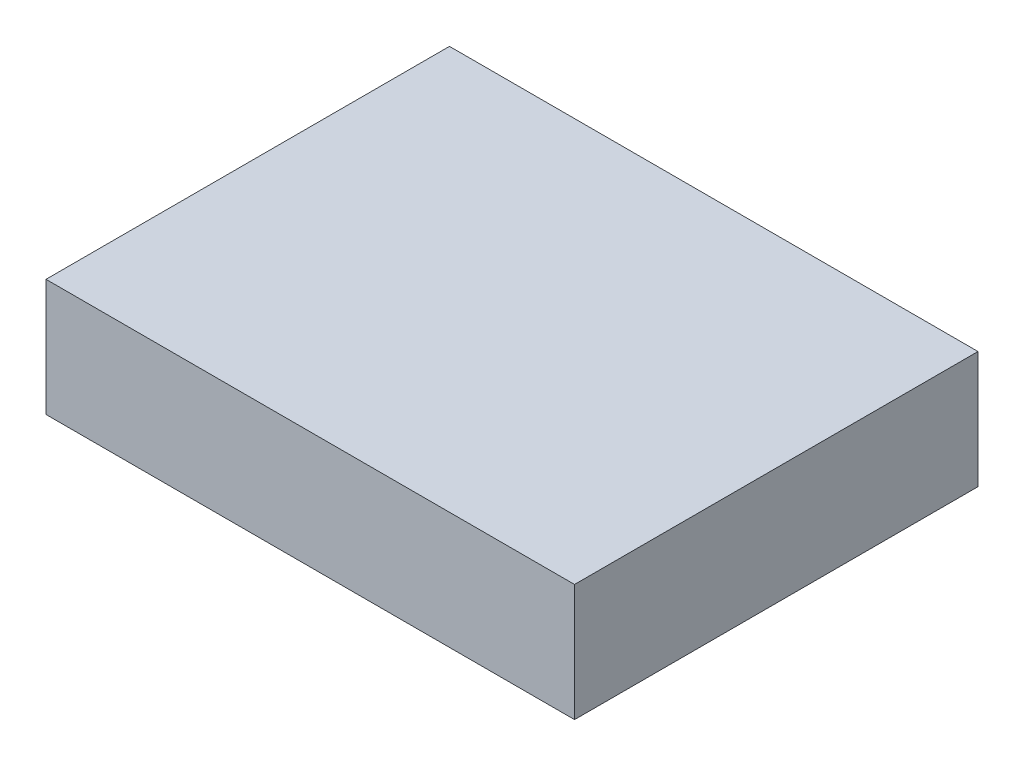
ISO-10303-21;
HEADER;
FILE_DESCRIPTION(('STEP AP214'),'2;1');
FILE_NAME('part.step','',(''),(''),'','','');
FILE_SCHEMA(('AUTOMOTIVE_DESIGN { 1 0 10303 214 1 1 1 1 }'));
ENDSEC;
DATA;
#1=APPLICATION_CONTEXT('core data for automotive mechanical design processes');
#2=APPLICATION_PROTOCOL_DEFINITION('international standard','automotive_design',2000,#1);
#3=PRODUCT_CONTEXT('',#1,'mechanical');
#4=PRODUCT('Part','Part','',(#3));
#5=PRODUCT_RELATED_PRODUCT_CATEGORY('part','',(#4));
#6=PRODUCT_DEFINITION_FORMATION('','',#4);
#7=PRODUCT_DEFINITION_CONTEXT('part definition',#1,'design');
#8=PRODUCT_DEFINITION('design','',#6,#7);
#9=PRODUCT_DEFINITION_SHAPE('','',#8);
#10=(LENGTH_UNIT() NAMED_UNIT(*) SI_UNIT(.MILLI.,.METRE.));
#11=(NAMED_UNIT(*) PLANE_ANGLE_UNIT() SI_UNIT($,.RADIAN.));
#12=(NAMED_UNIT(*) SI_UNIT($,.STERADIAN.) SOLID_ANGLE_UNIT());
#13=UNCERTAINTY_MEASURE_WITH_UNIT(LENGTH_MEASURE(1.E-05),#10,'distance_accuracy_value','');
#14=(GEOMETRIC_REPRESENTATION_CONTEXT(3) GLOBAL_UNCERTAINTY_ASSIGNED_CONTEXT((#13)) GLOBAL_UNIT_ASSIGNED_CONTEXT((#10,
#11,#12)) REPRESENTATION_CONTEXT('',''));
#15=CARTESIAN_POINT('',(0.,0.,0.));
#16=DIRECTION('',(0.,0.,1.));
#17=DIRECTION('',(1.,0.,0.));
#18=AXIS2_PLACEMENT_3D('',#15,#16,#17);
#19=CARTESIAN_POINT('',(-111.585836478848,150.,86.1531671959199));
#20=DIRECTION('',(-1.,0.,0.));
#21=DIRECTION('',(0.,0.,1.));
#22=AXIS2_PLACEMENT_3D('',#19,#20,#21);
#23=PLANE('',#22);
#24=DIRECTION('',(0.,0.,-1.));
#25=VECTOR('',#24,1.);
#26=CARTESIAN_POINT('',(-111.585836478848,100.,86.1531671959199));
#27=LINE('',#26,#25);
#28=CARTESIAN_POINT('',(-111.585836478848,100.,86.1531671959199));
#29=VERTEX_POINT('',#28);
#30=CARTESIAN_POINT('',(-111.585836478848,100.,-86.1531671959199));
#31=VERTEX_POINT('',#30);
#32=EDGE_CURVE('E232',#29,#31,#27,.T.);
#33=ORIENTED_EDGE('',*,*,#32,.F.);
#34=DIRECTION('',(0.,-1.,0.));
#35=VECTOR('',#34,1.);
#36=CARTESIAN_POINT('',(-111.585836478848,150.,86.1531671959199));
#37=LINE('',#36,#35);
#38=CARTESIAN_POINT('',(-111.585836478848,150.,86.1531671959199));
#39=VERTEX_POINT('',#38);
#40=EDGE_CURVE('E242',#39,#29,#37,.T.);
#41=ORIENTED_EDGE('',*,*,#40,.F.);
#42=DIRECTION('',(0.,0.,-1.));
#43=VECTOR('',#42,1.);
#44=CARTESIAN_POINT('',(-111.585836478848,150.,86.1531671959199));
#45=LINE('',#44,#43);
#46=CARTESIAN_POINT('',(-111.585836478848,150.,-86.1531671959199));
#47=VERTEX_POINT('',#46);
#48=EDGE_CURVE('E256',#39,#47,#45,.T.);
#49=ORIENTED_EDGE('',*,*,#48,.T.);
#50=DIRECTION('',(0.,-1.,0.));
#51=VECTOR('',#50,1.);
#52=CARTESIAN_POINT('',(-111.585836478848,150.,-86.1531671959199));
#53=LINE('',#52,#51);
#54=EDGE_CURVE('E253',#47,#31,#53,.T.);
#55=ORIENTED_EDGE('',*,*,#54,.T.);
#56=EDGE_LOOP('',(#33,#41,#49,#55));
#57=FACE_BOUND('',#56,.T.);
#58=ADVANCED_FACE('F41',(#57),#23,.T.);
#59=CARTESIAN_POINT('',(-111.585836478848,150.,86.1531671959199));
#60=DIRECTION('',(0.,0.,1.));
#61=DIRECTION('',(1.,0.,0.));
#62=AXIS2_PLACEMENT_3D('',#59,#60,#61);
#63=PLANE('',#62);
#64=DIRECTION('',(-1.,0.,0.));
#65=VECTOR('',#64,1.);
#66=CARTESIAN_POINT('',(-111.585836478848,100.,86.1531671959199));
#67=LINE('',#66,#65);
#68=CARTESIAN_POINT('',(114.129103407141,100.,86.1531671959199));
#69=VERTEX_POINT('',#68);
#70=EDGE_CURVE('E149',#69,#29,#67,.T.);
#71=ORIENTED_EDGE('',*,*,#70,.F.);
#72=DIRECTION('',(0.,-1.,0.));
#73=VECTOR('',#72,1.);
#74=CARTESIAN_POINT('',(114.129103407141,150.,86.1531671959199));
#75=LINE('',#74,#73);
#76=CARTESIAN_POINT('',(114.129103407141,150.,86.1531671959199));
#77=VERTEX_POINT('',#76);
#78=EDGE_CURVE('E247',#77,#69,#75,.T.);
#79=ORIENTED_EDGE('',*,*,#78,.F.);
#80=DIRECTION('',(-1.,0.,0.));
#81=VECTOR('',#80,1.);
#82=CARTESIAN_POINT('',(-111.585836478848,150.,86.1531671959199));
#83=LINE('',#82,#81);
#84=EDGE_CURVE('E246',#77,#39,#83,.T.);
#85=ORIENTED_EDGE('',*,*,#84,.T.);
#86=ORIENTED_EDGE('',*,*,#40,.T.);
#87=EDGE_LOOP('',(#71,#79,#85,#86));
#88=FACE_BOUND('',#87,.T.);
#89=ADVANCED_FACE('F450',(#88),#63,.T.);
#90=CARTESIAN_POINT('',(114.129103407141,150.,86.1531671959199));
#91=DIRECTION('',(1.,0.,0.));
#92=DIRECTION('',(0.,0.,-1.));
#93=AXIS2_PLACEMENT_3D('',#90,#91,#92);
#94=PLANE('',#93);
#95=DIRECTION('',(0.,0.,1.));
#96=VECTOR('',#95,1.);
#97=CARTESIAN_POINT('',(114.129103407141,100.,86.1531671959199));
#98=LINE('',#97,#96);
#99=CARTESIAN_POINT('',(114.129103407141,100.,-86.1531671959199));
#100=VERTEX_POINT('',#99);
#101=EDGE_CURVE('E171',#100,#69,#98,.T.);
#102=ORIENTED_EDGE('',*,*,#101,.F.);
#103=DIRECTION('',(0.,-1.,0.));
#104=VECTOR('',#103,1.);
#105=CARTESIAN_POINT('',(114.129103407141,150.,-86.1531671959199));
#106=LINE('',#105,#104);
#107=CARTESIAN_POINT('',(114.129103407141,150.,-86.1531671959199));
#108=VERTEX_POINT('',#107);
#109=EDGE_CURVE('E212',#108,#100,#106,.T.);
#110=ORIENTED_EDGE('',*,*,#109,.F.);
#111=DIRECTION('',(0.,0.,1.));
#112=VECTOR('',#111,1.);
#113=CARTESIAN_POINT('',(114.129103407141,150.,86.1531671959199));
#114=LINE('',#113,#112);
#115=EDGE_CURVE('E245',#108,#77,#114,.T.);
#116=ORIENTED_EDGE('',*,*,#115,.T.);
#117=ORIENTED_EDGE('',*,*,#78,.T.);
#118=EDGE_LOOP('',(#102,#110,#116,#117));
#119=FACE_BOUND('',#118,.T.);
#120=ADVANCED_FACE('F457',(#119),#94,.T.);
#121=CARTESIAN_POINT('',(-111.585836478848,150.,-86.1531671959199));
#122=DIRECTION('',(0.,0.,-1.));
#123=DIRECTION('',(-1.,0.,0.));
#124=AXIS2_PLACEMENT_3D('',#121,#122,#123);
#125=PLANE('',#124);
#126=DIRECTION('',(1.,0.,0.));
#127=VECTOR('',#126,1.);
#128=CARTESIAN_POINT('',(-111.585836478848,100.,-86.1531671959199));
#129=LINE('',#128,#127);
#130=EDGE_CURVE('E235',#31,#100,#129,.T.);
#131=ORIENTED_EDGE('',*,*,#130,.F.);
#132=ORIENTED_EDGE('',*,*,#54,.F.);
#133=DIRECTION('',(1.,0.,0.));
#134=VECTOR('',#133,1.);
#135=CARTESIAN_POINT('',(-111.585836478848,150.,-86.1531671959199));
#136=LINE('',#135,#134);
#137=EDGE_CURVE('E250',#47,#108,#136,.T.);
#138=ORIENTED_EDGE('',*,*,#137,.T.);
#139=ORIENTED_EDGE('',*,*,#109,.T.);
#140=EDGE_LOOP('',(#131,#132,#138,#139));
#141=FACE_BOUND('',#140,.T.);
#142=ADVANCED_FACE('F648',(#141),#125,.T.);
#143=CARTESIAN_POINT('',(0.,150.,0.));
#144=DIRECTION('',(0.,-1.,0.));
#145=DIRECTION('',(0.,0.,-1.));
#146=AXIS2_PLACEMENT_3D('',#143,#144,#145);
#147=PLANE('',#146);
#148=ORIENTED_EDGE('',*,*,#48,.F.);
#149=ORIENTED_EDGE('',*,*,#84,.F.);
#150=ORIENTED_EDGE('',*,*,#115,.F.);
#151=ORIENTED_EDGE('',*,*,#137,.F.);
#152=EDGE_LOOP('',(#148,#149,#150,#151));
#153=FACE_BOUND('',#152,.T.);
#154=ADVANCED_FACE('F466',(#153),#147,.F.);
#155=CARTESIAN_POINT('',(0.,100.,0.));
#156=DIRECTION('',(0.,-1.,0.));
#157=DIRECTION('',(0.,0.,-1.));
#158=AXIS2_PLACEMENT_3D('',#155,#156,#157);
#159=PLANE('',#158);
#160=DIRECTION('',(1.,0.,0.));
#161=VECTOR('',#160,1.);
#162=CARTESIAN_POINT('',(0.,100.,11.3837952969598));
#163=LINE('',#162,#161);
#164=CARTESIAN_POINT('',(-36.,100.,11.3837952969598));
#165=VERTEX_POINT('',#164);
#166=CARTESIAN_POINT('',(36.,100.,11.3837952969598));
#167=VERTEX_POINT('',#166);
#168=EDGE_CURVE('E155',#165,#167,#163,.T.);
#169=ORIENTED_EDGE('',*,*,#168,.F.);
#170=DIRECTION('',(0.,0.,1.));
#171=VECTOR('',#170,1.);
#172=CARTESIAN_POINT('',(-36.,100.,0.));
#173=LINE('',#172,#171);
#174=CARTESIAN_POINT('',(-36.,100.,-15.2367721667));
#175=VERTEX_POINT('',#174);
#176=EDGE_CURVE('E228',#175,#165,#173,.T.);
#177=ORIENTED_EDGE('',*,*,#176,.F.);
#178=DIRECTION('',(-1.,0.,0.));
#179=VECTOR('',#178,1.);
#180=CARTESIAN_POINT('',(0.,100.,-15.2367721667));
#181=LINE('',#180,#179);
#182=CARTESIAN_POINT('',(36.,100.,-15.2367721667));
#183=VERTEX_POINT('',#182);
#184=EDGE_CURVE('E219',#183,#175,#181,.T.);
#185=ORIENTED_EDGE('',*,*,#184,.F.);
#186=DIRECTION('',(0.,0.,-1.));
#187=VECTOR('',#186,1.);
#188=CARTESIAN_POINT('',(36.,100.,0.));
#189=LINE('',#188,#187);
#190=EDGE_CURVE('E213',#167,#183,#189,.T.);
#191=ORIENTED_EDGE('',*,*,#190,.F.);
#192=EDGE_LOOP('',(#169,#177,#185,#191));
#193=FACE_BOUND('',#192,.T.);
#194=ADVANCED_FACE('F293',(#193),#159,.T.);
#195=CARTESIAN_POINT('',(0.,100.,-60.));
#196=DIRECTION('',(0.,0.0174524064372835,-0.999847695156391));
#197=DIRECTION('',(0.,0.999847695156391,0.0174524064372835));
#198=AXIS2_PLACEMENT_3D('',#195,#196,#197);
#199=PLANE('',#198);
#200=DIRECTION('',(1.,0.,0.));
#201=VECTOR('',#200,1.);
#202=CARTESIAN_POINT('',(0.,107.,-59.8778145455025));
#203=LINE('',#202,#201);
#204=CARTESIAN_POINT('',(80.,107.,-59.8778145455025));
#205=VERTEX_POINT('',#204);
#206=CARTESIAN_POINT('',(-80.,107.,-59.8778145455025));
#207=VERTEX_POINT('',#206);
#208=EDGE_CURVE('E137',#205,#207,#203,.F.);
#209=ORIENTED_EDGE('',*,*,#208,.T.);
#210=DIRECTION('',(0.,-0.999847695156391,-0.0174524064372835));
#211=VECTOR('',#210,1.);
#212=CARTESIAN_POINT('',(-80.,100.,-60.));
#213=LINE('',#212,#211);
#214=CARTESIAN_POINT('',(-80.,100.,-60.));
#215=VERTEX_POINT('',#214);
#216=EDGE_CURVE('E194',#215,#207,#213,.F.);
#217=ORIENTED_EDGE('',*,*,#216,.F.);
#218=DIRECTION('',(1.,0.,0.));
#219=VECTOR('',#218,1.);
#220=CARTESIAN_POINT('',(0.,100.,-60.));
#221=LINE('',#220,#219);
#222=CARTESIAN_POINT('',(80.,100.,-60.));
#223=VERTEX_POINT('',#222);
#224=EDGE_CURVE('E170',#223,#215,#221,.F.);
#225=ORIENTED_EDGE('',*,*,#224,.F.);
#226=DIRECTION('',(0.,-0.999847695156391,-0.0174524064372835));
#227=VECTOR('',#226,1.);
#228=CARTESIAN_POINT('',(80.,100.,-60.));
#229=LINE('',#228,#227);
#230=EDGE_CURVE('E138',#205,#223,#229,.T.);
#231=ORIENTED_EDGE('',*,*,#230,.F.);
#232=EDGE_LOOP('',(#209,#217,#225,#231));
#233=FACE_BOUND('',#232,.T.);
#234=ADVANCED_FACE('F465',(#233),#199,.F.);
#235=CARTESIAN_POINT('',(-80.,100.,-55.));
#236=DIRECTION('',(0.,-1.,0.));
#237=DIRECTION('',(0.,0.,1.));
#238=AXIS2_PLACEMENT_3D('',#235,#236,#237);
#239=CONICAL_SURFACE('',#238,5.,0.0174532925199433);
#240=CARTESIAN_POINT('',(-80.,107.,-55.));
#241=DIRECTION('',(0.,1.,0.));
#242=DIRECTION('',(0.,0.,1.));
#243=AXIS2_PLACEMENT_3D('',#240,#241,#242);
#244=CIRCLE('',#243,4.87781454550248);
#245=CARTESIAN_POINT('',(-84.8778145455025,107.,-55.));
#246=VERTEX_POINT('',#245);
#247=EDGE_CURVE('E204',#207,#246,#244,.T.);
#248=ORIENTED_EDGE('',*,*,#247,.T.);
#249=DIRECTION('',(-0.0174524064372835,-0.999847695156391,0.));
#250=VECTOR('',#249,1.);
#251=CARTESIAN_POINT('',(-85.,100.,-55.));
#252=LINE('',#251,#250);
#253=CARTESIAN_POINT('',(-85.,100.,-55.));
#254=VERTEX_POINT('',#253);
#255=EDGE_CURVE('E201',#246,#254,#252,.T.);
#256=ORIENTED_EDGE('',*,*,#255,.T.);
#257=CARTESIAN_POINT('',(-80.,100.,-55.));
#258=DIRECTION('',(0.,-1.,0.));
#259=DIRECTION('',(0.,0.,-1.));
#260=AXIS2_PLACEMENT_3D('',#257,#258,#259);
#261=CIRCLE('',#260,5.);
#262=EDGE_CURVE('E197',#254,#215,#261,.T.);
#263=ORIENTED_EDGE('',*,*,#262,.T.);
#264=ORIENTED_EDGE('',*,*,#216,.T.);
#265=EDGE_LOOP('',(#248,#256,#263,#264));
#266=FACE_BOUND('',#265,.T.);
#267=ADVANCED_FACE('F469',(#266),#239,.F.);
#268=CARTESIAN_POINT('',(-85.,100.,0.));
#269=DIRECTION('',(-0.999847695156391,0.0174524064372835,0.));
#270=DIRECTION('',(-0.0174524064372835,-0.999847695156391,0.));
#271=AXIS2_PLACEMENT_3D('',#268,#269,#270);
#272=PLANE('',#271);
#273=DIRECTION('',(0.,0.,-1.));
#274=VECTOR('',#273,1.);
#275=CARTESIAN_POINT('',(-85.,100.,0.));
#276=LINE('',#275,#274);
#277=CARTESIAN_POINT('',(-85.,100.,55.));
#278=VERTEX_POINT('',#277);
#279=EDGE_CURVE('E53',#254,#278,#276,.F.);
#280=ORIENTED_EDGE('',*,*,#279,.F.);
#281=ORIENTED_EDGE('',*,*,#255,.F.);
#282=DIRECTION('',(0.,0.,-1.));
#283=VECTOR('',#282,1.);
#284=CARTESIAN_POINT('',(-84.8778145455025,107.,0.));
#285=LINE('',#284,#283);
#286=CARTESIAN_POINT('',(-84.8778145455025,107.,55.));
#287=VERTEX_POINT('',#286);
#288=EDGE_CURVE('E190',#246,#287,#285,.F.);
#289=ORIENTED_EDGE('',*,*,#288,.T.);
#290=DIRECTION('',(-0.0174524064372835,-0.999847695156391,0.));
#291=VECTOR('',#290,1.);
#292=CARTESIAN_POINT('',(-85.,100.,55.));
#293=LINE('',#292,#291);
#294=EDGE_CURVE('E179',#278,#287,#293,.F.);
#295=ORIENTED_EDGE('',*,*,#294,.F.);
#296=EDGE_LOOP('',(#280,#281,#289,#295));
#297=FACE_BOUND('',#296,.T.);
#298=ADVANCED_FACE('F473',(#297),#272,.F.);
#299=CARTESIAN_POINT('',(-80.,100.,55.));
#300=DIRECTION('',(0.,-1.,0.));
#301=DIRECTION('',(0.,0.,1.));
#302=AXIS2_PLACEMENT_3D('',#299,#300,#301);
#303=CONICAL_SURFACE('',#302,5.,0.0174532925199433);
#304=CARTESIAN_POINT('',(-80.,107.,55.));
#305=DIRECTION('',(0.,1.,0.));
#306=DIRECTION('',(0.,0.,1.));
#307=AXIS2_PLACEMENT_3D('',#304,#305,#306);
#308=CIRCLE('',#307,4.87781454550248);
#309=CARTESIAN_POINT('',(-80.,107.,59.8778145455025));
#310=VERTEX_POINT('',#309);
#311=EDGE_CURVE('E188',#287,#310,#308,.T.);
#312=ORIENTED_EDGE('',*,*,#311,.T.);
#313=DIRECTION('',(0.,-0.999847695156391,0.0174524064372835));
#314=VECTOR('',#313,1.);
#315=CARTESIAN_POINT('',(-80.,100.,60.));
#316=LINE('',#315,#314);
#317=CARTESIAN_POINT('',(-80.,100.,60.));
#318=VERTEX_POINT('',#317);
#319=EDGE_CURVE('E185',#310,#318,#316,.T.);
#320=ORIENTED_EDGE('',*,*,#319,.T.);
#321=CARTESIAN_POINT('',(-80.,100.,55.));
#322=DIRECTION('',(0.,-1.,0.));
#323=DIRECTION('',(0.,0.,-1.));
#324=AXIS2_PLACEMENT_3D('',#321,#322,#323);
#325=CIRCLE('',#324,5.);
#326=EDGE_CURVE('E181',#318,#278,#325,.T.);
#327=ORIENTED_EDGE('',*,*,#326,.T.);
#328=ORIENTED_EDGE('',*,*,#294,.T.);
#329=EDGE_LOOP('',(#312,#320,#327,#328));
#330=FACE_BOUND('',#329,.T.);
#331=ADVANCED_FACE('F477',(#330),#303,.F.);
#332=CARTESIAN_POINT('',(0.,100.,60.));
#333=DIRECTION('',(0.,0.0174524064372835,0.999847695156391));
#334=DIRECTION('',(0.,-0.999847695156391,0.0174524064372835));
#335=AXIS2_PLACEMENT_3D('',#332,#333,#334);
#336=PLANE('',#335);
#337=DIRECTION('',(-1.,0.,0.));
#338=VECTOR('',#337,1.);
#339=CARTESIAN_POINT('',(0.,100.,60.));
#340=LINE('',#339,#338);
#341=CARTESIAN_POINT('',(80.,100.,60.));
#342=VERTEX_POINT('',#341);
#343=EDGE_CURVE('E11',#318,#342,#340,.F.);
#344=ORIENTED_EDGE('',*,*,#343,.F.);
#345=ORIENTED_EDGE('',*,*,#319,.F.);
#346=DIRECTION('',(-1.,0.,0.));
#347=VECTOR('',#346,1.);
#348=CARTESIAN_POINT('',(0.,107.,59.8778145455025));
#349=LINE('',#348,#347);
#350=CARTESIAN_POINT('',(80.,107.,59.8778145455025));
#351=VERTEX_POINT('',#350);
#352=EDGE_CURVE('E177',#310,#351,#349,.F.);
#353=ORIENTED_EDGE('',*,*,#352,.T.);
#354=DIRECTION('',(0.,-0.999847695156391,0.0174524064372835));
#355=VECTOR('',#354,1.);
#356=CARTESIAN_POINT('',(80.,100.,60.));
#357=LINE('',#356,#355);
#358=EDGE_CURVE('E156',#342,#351,#357,.F.);
#359=ORIENTED_EDGE('',*,*,#358,.F.);
#360=EDGE_LOOP('',(#344,#345,#353,#359));
#361=FACE_BOUND('',#360,.T.);
#362=ADVANCED_FACE('F481',(#361),#336,.F.);
#363=CARTESIAN_POINT('',(80.,100.,55.));
#364=DIRECTION('',(0.,-1.,0.));
#365=DIRECTION('',(0.,0.,1.));
#366=AXIS2_PLACEMENT_3D('',#363,#364,#365);
#367=CONICAL_SURFACE('',#366,5.,0.0174532925199433);
#368=CARTESIAN_POINT('',(80.,107.,55.));
#369=DIRECTION('',(0.,1.,0.));
#370=DIRECTION('',(0.,0.,1.));
#371=AXIS2_PLACEMENT_3D('',#368,#369,#370);
#372=CIRCLE('',#371,4.87781454550248);
#373=CARTESIAN_POINT('',(84.8778145455025,107.,55.));
#374=VERTEX_POINT('',#373);
#375=EDGE_CURVE('E176',#351,#374,#372,.T.);
#376=ORIENTED_EDGE('',*,*,#375,.T.);
#377=DIRECTION('',(0.0174524064372835,-0.999847695156391,0.));
#378=VECTOR('',#377,1.);
#379=CARTESIAN_POINT('',(85.,100.,55.));
#380=LINE('',#379,#378);
#381=CARTESIAN_POINT('',(85.,100.,55.));
#382=VERTEX_POINT('',#381);
#383=EDGE_CURVE('E154',#374,#382,#380,.T.);
#384=ORIENTED_EDGE('',*,*,#383,.T.);
#385=CARTESIAN_POINT('',(80.,100.,55.));
#386=DIRECTION('',(0.,-1.,0.));
#387=DIRECTION('',(0.,0.,-1.));
#388=AXIS2_PLACEMENT_3D('',#385,#386,#387);
#389=CIRCLE('',#388,5.);
#390=EDGE_CURVE('E162',#382,#342,#389,.T.);
#391=ORIENTED_EDGE('',*,*,#390,.T.);
#392=ORIENTED_EDGE('',*,*,#358,.T.);
#393=EDGE_LOOP('',(#376,#384,#391,#392));
#394=FACE_BOUND('',#393,.T.);
#395=ADVANCED_FACE('F485',(#394),#367,.F.);
#396=CARTESIAN_POINT('',(85.,100.,0.));
#397=DIRECTION('',(0.999847695156391,0.0174524064372835,0.));
#398=DIRECTION('',(-0.0174524064372835,0.999847695156391,0.));
#399=AXIS2_PLACEMENT_3D('',#396,#397,#398);
#400=PLANE('',#399);
#401=DIRECTION('',(0.,0.,1.));
#402=VECTOR('',#401,1.);
#403=CARTESIAN_POINT('',(85.,100.,0.));
#404=LINE('',#403,#402);
#405=CARTESIAN_POINT('',(85.,100.,-55.));
#406=VERTEX_POINT('',#405);
#407=EDGE_CURVE('E166',#382,#406,#404,.F.);
#408=ORIENTED_EDGE('',*,*,#407,.F.);
#409=ORIENTED_EDGE('',*,*,#383,.F.);
#410=DIRECTION('',(0.,0.,1.));
#411=VECTOR('',#410,1.);
#412=CARTESIAN_POINT('',(84.8778145455025,107.,0.));
#413=LINE('',#412,#411);
#414=CARTESIAN_POINT('',(84.8778145455025,107.,-55.));
#415=VERTEX_POINT('',#414);
#416=EDGE_CURVE('E134',#374,#415,#413,.F.);
#417=ORIENTED_EDGE('',*,*,#416,.T.);
#418=DIRECTION('',(0.0174524064372835,-0.999847695156391,0.));
#419=VECTOR('',#418,1.);
#420=CARTESIAN_POINT('',(85.,100.,-55.));
#421=LINE('',#420,#419);
#422=EDGE_CURVE('E143',#406,#415,#421,.F.);
#423=ORIENTED_EDGE('',*,*,#422,.F.);
#424=EDGE_LOOP('',(#408,#409,#417,#423));
#425=FACE_BOUND('',#424,.T.);
#426=ADVANCED_FACE('F152',(#425),#400,.F.);
#427=CARTESIAN_POINT('',(0.,100.,11.3837952969598));
#428=DIRECTION('',(0.,0.0174524064372835,-0.999847695156391));
#429=DIRECTION('',(0.,0.999847695156391,0.0174524064372835));
#430=AXIS2_PLACEMENT_3D('',#427,#428,#429);
#431=PLANE('',#430);
#432=DIRECTION('',(-1.,0.,0.));
#433=VECTOR('',#432,1.);
#434=CARTESIAN_POINT('',(0.,107.,11.5059807514573));
#435=LINE('',#434,#433);
#436=CARTESIAN_POINT('',(-36.1221854544975,107.,11.5059807514573));
#437=VERTEX_POINT('',#436);
#438=CARTESIAN_POINT('',(36.1221854544975,107.,11.5059807514573));
#439=VERTEX_POINT('',#438);
#440=EDGE_CURVE('E139',#437,#439,#435,.F.);
#441=ORIENTED_EDGE('',*,*,#440,.F.);
#442=DIRECTION('',(-0.0174497491606827,0.999695459881887,0.0174497491606827));
#443=VECTOR('',#442,1.);
#444=CARTESIAN_POINT('',(-35.9965337055289,99.8014161227521,11.3803290024887));
#445=LINE('',#444,#443);
#446=EDGE_CURVE('E230',#165,#437,#445,.T.);
#447=ORIENTED_EDGE('',*,*,#446,.F.);
#448=ORIENTED_EDGE('',*,*,#168,.T.);
#449=DIRECTION('',(0.0174497491606827,0.999695459881887,0.0174497491606827));
#450=VECTOR('',#449,1.);
#451=CARTESIAN_POINT('',(35.9890382251522,99.3720003395675,11.372833522112));
#452=LINE('',#451,#450);
#453=EDGE_CURVE('E159',#167,#439,#452,.T.);
#454=ORIENTED_EDGE('',*,*,#453,.T.);
#455=EDGE_LOOP('',(#441,#447,#448,#454));
#456=FACE_BOUND('',#455,.T.);
#457=ADVANCED_FACE('F285',(#456),#431,.F.);
#458=CARTESIAN_POINT('',(-36.,100.,0.));
#459=DIRECTION('',(0.999847695156391,0.0174524064372835,0.));
#460=DIRECTION('',(-0.0174524064372835,0.999847695156391,0.));
#461=AXIS2_PLACEMENT_3D('',#458,#459,#460);
#462=PLANE('',#461);
#463=DIRECTION('',(0.,0.,-1.));
#464=VECTOR('',#463,1.);
#465=CARTESIAN_POINT('',(-36.1221854544975,107.,0.));
#466=LINE('',#465,#464);
#467=CARTESIAN_POINT('',(-36.1221854544975,107.,-15.3589576211975));
#468=VERTEX_POINT('',#467);
#469=EDGE_CURVE('E270',#468,#437,#466,.F.);
#470=ORIENTED_EDGE('',*,*,#469,.F.);
#471=DIRECTION('',(-0.0174497491606827,0.999695459881887,-0.0174497491606827));
#472=VECTOR('',#471,1.);
#473=CARTESIAN_POINT('',(-35.9890382251522,99.3720003395675,-15.2258103918523));
#474=LINE('',#473,#472);
#475=EDGE_CURVE('E218',#175,#468,#474,.T.);
#476=ORIENTED_EDGE('',*,*,#475,.F.);
#477=ORIENTED_EDGE('',*,*,#176,.T.);
#478=ORIENTED_EDGE('',*,*,#446,.T.);
#479=EDGE_LOOP('',(#470,#476,#477,#478));
#480=FACE_BOUND('',#479,.T.);
#481=ADVANCED_FACE('F494',(#480),#462,.F.);
#482=CARTESIAN_POINT('',(0.,100.,-15.2367721667));
#483=DIRECTION('',(0.,0.0174524064372835,0.999847695156391));
#484=DIRECTION('',(0.,-0.999847695156391,0.0174524064372835));
#485=AXIS2_PLACEMENT_3D('',#482,#483,#484);
#486=PLANE('',#485);
#487=DIRECTION('',(1.,0.,0.));
#488=VECTOR('',#487,1.);
#489=CARTESIAN_POINT('',(0.,107.,-15.3589576211975));
#490=LINE('',#489,#488);
#491=CARTESIAN_POINT('',(36.1221854544975,107.,-15.3589576211975));
#492=VERTEX_POINT('',#491);
#493=EDGE_CURVE('E267',#492,#468,#490,.F.);
#494=ORIENTED_EDGE('',*,*,#493,.F.);
#495=DIRECTION('',(0.0174497491606827,0.999695459881887,-0.0174497491606827));
#496=VECTOR('',#495,1.);
#497=CARTESIAN_POINT('',(35.9953604981695,99.7342031181452,-15.2321326648695));
#498=LINE('',#497,#496);
#499=EDGE_CURVE('E217',#183,#492,#498,.T.);
#500=ORIENTED_EDGE('',*,*,#499,.F.);
#501=ORIENTED_EDGE('',*,*,#184,.T.);
#502=ORIENTED_EDGE('',*,*,#475,.T.);
#503=EDGE_LOOP('',(#494,#500,#501,#502));
#504=FACE_BOUND('',#503,.T.);
#505=ADVANCED_FACE('F447',(#504),#486,.F.);
#506=CARTESIAN_POINT('',(36.,100.,0.));
#507=DIRECTION('',(-0.999847695156391,0.0174524064372835,0.));
#508=DIRECTION('',(-0.0174524064372835,-0.999847695156391,0.));
#509=AXIS2_PLACEMENT_3D('',#506,#507,#508);
#510=PLANE('',#509);
#511=DIRECTION('',(0.,0.,1.));
#512=VECTOR('',#511,1.);
#513=CARTESIAN_POINT('',(36.1221854544975,107.,0.));
#514=LINE('',#513,#512);
#515=EDGE_CURVE('E265',#439,#492,#514,.F.);
#516=ORIENTED_EDGE('',*,*,#515,.F.);
#517=ORIENTED_EDGE('',*,*,#453,.F.);
#518=ORIENTED_EDGE('',*,*,#190,.T.);
#519=ORIENTED_EDGE('',*,*,#499,.T.);
#520=EDGE_LOOP('',(#516,#517,#518,#519));
#521=FACE_BOUND('',#520,.T.);
#522=ADVANCED_FACE('F289',(#521),#510,.F.);
#523=CARTESIAN_POINT('',(-80.,100.,-55.));
#524=DIRECTION('',(0.,1.,0.));
#525=DIRECTION('',(0.,0.,1.));
#526=AXIS2_PLACEMENT_3D('',#523,#524,#525);
#527=CONICAL_SURFACE('',#526,2.,0.0174532925199433);
#528=CARTESIAN_POINT('',(-80.,100.,-55.));
#529=DIRECTION('',(0.,1.,0.));
#530=DIRECTION('',(0.,0.,1.));
#531=AXIS2_PLACEMENT_3D('',#528,#529,#530);
#532=CIRCLE('',#531,2.);
#533=CARTESIAN_POINT('',(-80.,100.,-53.));
#534=VERTEX_POINT('',#533);
#535=EDGE_CURVE('E264',#534,#534,#532,.T.);
#536=ORIENTED_EDGE('',*,*,#535,.T.);
#537=EDGE_LOOP('',(#536));
#538=FACE_BOUND('',#537,.T.);
#539=CARTESIAN_POINT('',(-80.,107.,-55.));
#540=DIRECTION('',(0.,1.,0.));
#541=DIRECTION('',(0.,0.,1.));
#542=AXIS2_PLACEMENT_3D('',#539,#540,#541);
#543=CIRCLE('',#542,2.12218545449752);
#544=CARTESIAN_POINT('',(-80.,107.,-52.8778145455025));
#545=VERTEX_POINT('',#544);
#546=EDGE_CURVE('E429',#545,#545,#543,.T.);
#547=ORIENTED_EDGE('',*,*,#546,.F.);
#548=EDGE_LOOP('',(#547));
#549=FACE_BOUND('',#548,.T.);
#550=ADVANCED_FACE('F434',(#538,#549),#527,.T.);
#551=CARTESIAN_POINT('',(-80.,100.,55.));
#552=DIRECTION('',(0.,1.,0.));
#553=DIRECTION('',(0.,0.,1.));
#554=AXIS2_PLACEMENT_3D('',#551,#552,#553);
#555=CONICAL_SURFACE('',#554,2.,0.0174532925199433);
#556=CARTESIAN_POINT('',(-80.,107.,55.));
#557=DIRECTION('',(0.,1.,0.));
#558=DIRECTION('',(0.,0.,1.));
#559=AXIS2_PLACEMENT_3D('',#556,#557,#558);
#560=CIRCLE('',#559,2.12218545449752);
#561=CARTESIAN_POINT('',(-80.,107.,57.1221854544975));
#562=VERTEX_POINT('',#561);
#563=EDGE_CURVE('E425',#562,#562,#560,.T.);
#564=ORIENTED_EDGE('',*,*,#563,.F.);
#565=EDGE_LOOP('',(#564));
#566=FACE_BOUND('',#565,.T.);
#567=CARTESIAN_POINT('',(-80.,100.,55.));
#568=DIRECTION('',(0.,1.,0.));
#569=DIRECTION('',(0.,0.,1.));
#570=AXIS2_PLACEMENT_3D('',#567,#568,#569);
#571=CIRCLE('',#570,2.);
#572=CARTESIAN_POINT('',(-80.,100.,57.));
#573=VERTEX_POINT('',#572);
#574=EDGE_CURVE('E361',#573,#573,#571,.T.);
#575=ORIENTED_EDGE('',*,*,#574,.T.);
#576=EDGE_LOOP('',(#575));
#577=FACE_BOUND('',#576,.T.);
#578=ADVANCED_FACE('F436',(#566,#577),#555,.T.);
#579=CARTESIAN_POINT('',(80.,100.,-55.));
#580=DIRECTION('',(0.,1.,0.));
#581=DIRECTION('',(0.,0.,1.));
#582=AXIS2_PLACEMENT_3D('',#579,#580,#581);
#583=CONICAL_SURFACE('',#582,2.,0.0174532925199433);
#584=CARTESIAN_POINT('',(80.,107.,-55.));
#585=DIRECTION('',(0.,1.,0.));
#586=DIRECTION('',(0.,0.,1.));
#587=AXIS2_PLACEMENT_3D('',#584,#585,#586);
#588=CIRCLE('',#587,2.12218545449752);
#589=CARTESIAN_POINT('',(80.,107.,-52.8778145455025));
#590=VERTEX_POINT('',#589);
#591=EDGE_CURVE('E422',#590,#590,#588,.T.);
#592=ORIENTED_EDGE('',*,*,#591,.F.);
#593=EDGE_LOOP('',(#592));
#594=FACE_BOUND('',#593,.T.);
#595=CARTESIAN_POINT('',(80.,100.,-55.));
#596=DIRECTION('',(0.,1.,0.));
#597=DIRECTION('',(0.,0.,1.));
#598=AXIS2_PLACEMENT_3D('',#595,#596,#597);
#599=CIRCLE('',#598,2.);
#600=CARTESIAN_POINT('',(80.,100.,-53.));
#601=VERTEX_POINT('',#600);
#602=EDGE_CURVE('E373',#601,#601,#599,.T.);
#603=ORIENTED_EDGE('',*,*,#602,.T.);
#604=EDGE_LOOP('',(#603));
#605=FACE_BOUND('',#604,.T.);
#606=ADVANCED_FACE('F444',(#594,#605),#583,.T.);
#607=CARTESIAN_POINT('',(80.,100.,55.));
#608=DIRECTION('',(0.,1.,0.));
#609=DIRECTION('',(0.,0.,1.));
#610=AXIS2_PLACEMENT_3D('',#607,#608,#609);
#611=CONICAL_SURFACE('',#610,2.,0.0174532925199433);
#612=CARTESIAN_POINT('',(80.,107.,55.));
#613=DIRECTION('',(0.,1.,0.));
#614=DIRECTION('',(0.,0.,1.));
#615=AXIS2_PLACEMENT_3D('',#612,#613,#614);
#616=CIRCLE('',#615,2.12218545449752);
#617=CARTESIAN_POINT('',(80.,107.,57.1221854544975));
#618=VERTEX_POINT('',#617);
#619=EDGE_CURVE('E395',#618,#618,#616,.T.);
#620=ORIENTED_EDGE('',*,*,#619,.F.);
#621=EDGE_LOOP('',(#620));
#622=FACE_BOUND('',#621,.T.);
#623=CARTESIAN_POINT('',(80.,100.,55.));
#624=DIRECTION('',(0.,1.,0.));
#625=DIRECTION('',(0.,0.,1.));
#626=AXIS2_PLACEMENT_3D('',#623,#624,#625);
#627=CIRCLE('',#626,2.);
#628=CARTESIAN_POINT('',(80.,100.,57.));
#629=VERTEX_POINT('',#628);
#630=EDGE_CURVE('E384',#629,#629,#627,.T.);
#631=ORIENTED_EDGE('',*,*,#630,.T.);
#632=EDGE_LOOP('',(#631));
#633=FACE_BOUND('',#632,.T.);
#634=ADVANCED_FACE('F534',(#622,#633),#611,.T.);
#635=CARTESIAN_POINT('',(0.,107.,0.));
#636=DIRECTION('',(0.,1.,0.));
#637=DIRECTION('',(0.,0.,1.));
#638=AXIS2_PLACEMENT_3D('',#635,#636,#637);
#639=PLANE('',#638);
#640=ORIENTED_EDGE('',*,*,#619,.T.);
#641=EDGE_LOOP('',(#640));
#642=FACE_BOUND('',#641,.T.);
#643=ORIENTED_EDGE('',*,*,#591,.T.);
#644=EDGE_LOOP('',(#643));
#645=FACE_BOUND('',#644,.T.);
#646=ORIENTED_EDGE('',*,*,#563,.T.);
#647=EDGE_LOOP('',(#646));
#648=FACE_BOUND('',#647,.T.);
#649=ORIENTED_EDGE('',*,*,#546,.T.);
#650=EDGE_LOOP('',(#649));
#651=FACE_BOUND('',#650,.T.);
#652=ORIENTED_EDGE('',*,*,#515,.T.);
#653=ORIENTED_EDGE('',*,*,#493,.T.);
#654=ORIENTED_EDGE('',*,*,#469,.T.);
#655=ORIENTED_EDGE('',*,*,#440,.T.);
#656=EDGE_LOOP('',(#652,#653,#654,#655));
#657=FACE_BOUND('',#656,.T.);
#658=ORIENTED_EDGE('',*,*,#416,.F.);
#659=ORIENTED_EDGE('',*,*,#375,.F.);
#660=ORIENTED_EDGE('',*,*,#352,.F.);
#661=ORIENTED_EDGE('',*,*,#311,.F.);
#662=ORIENTED_EDGE('',*,*,#288,.F.);
#663=ORIENTED_EDGE('',*,*,#247,.F.);
#664=ORIENTED_EDGE('',*,*,#208,.F.);
#665=CARTESIAN_POINT('',(80.,107.,-55.));
#666=DIRECTION('',(0.,1.,0.));
#667=DIRECTION('',(0.,0.,1.));
#668=AXIS2_PLACEMENT_3D('',#665,#666,#667);
#669=CIRCLE('',#668,4.87781454550248);
#670=EDGE_CURVE('E127',#415,#205,#669,.T.);
#671=ORIENTED_EDGE('',*,*,#670,.F.);
#672=EDGE_LOOP('',(#658,#659,#660,#661,#662,#663,#664,#671));
#673=FACE_BOUND('',#672,.T.);
#674=ADVANCED_FACE('F131',(#642,#645,#648,#651,#657,#673),#639,.F.);
#675=CARTESIAN_POINT('',(80.,100.,-55.));
#676=DIRECTION('',(0.,-1.,0.));
#677=DIRECTION('',(0.,0.,1.));
#678=AXIS2_PLACEMENT_3D('',#675,#676,#677);
#679=CONICAL_SURFACE('',#678,5.,0.0174532925199433);
#680=ORIENTED_EDGE('',*,*,#670,.T.);
#681=ORIENTED_EDGE('',*,*,#230,.T.);
#682=CARTESIAN_POINT('',(80.,100.,-55.));
#683=DIRECTION('',(0.,-1.,0.));
#684=DIRECTION('',(0.,0.,-1.));
#685=AXIS2_PLACEMENT_3D('',#682,#683,#684);
#686=CIRCLE('',#685,5.);
#687=EDGE_CURVE('E146',#223,#406,#686,.T.);
#688=ORIENTED_EDGE('',*,*,#687,.T.);
#689=ORIENTED_EDGE('',*,*,#422,.T.);
#690=EDGE_LOOP('',(#680,#681,#688,#689));
#691=FACE_BOUND('',#690,.T.);
#692=ADVANCED_FACE('F144',(#691),#679,.F.);
#693=CARTESIAN_POINT('',(0.,100.,0.));
#694=DIRECTION('',(0.,-1.,0.));
#695=DIRECTION('',(0.,0.,-1.));
#696=AXIS2_PLACEMENT_3D('',#693,#694,#695);
#697=PLANE('',#696);
#698=ORIENTED_EDGE('',*,*,#535,.F.);
#699=EDGE_LOOP('',(#698));
#700=FACE_BOUND('',#699,.T.);
#701=ADVANCED_FACE('F627',(#700),#697,.T.);
#702=CARTESIAN_POINT('',(0.,100.,0.));
#703=DIRECTION('',(0.,-1.,0.));
#704=DIRECTION('',(0.,0.,-1.));
#705=AXIS2_PLACEMENT_3D('',#702,#703,#704);
#706=PLANE('',#705);
#707=ORIENTED_EDGE('',*,*,#574,.F.);
#708=EDGE_LOOP('',(#707));
#709=FACE_BOUND('',#708,.T.);
#710=ADVANCED_FACE('F575',(#709),#706,.T.);
#711=CARTESIAN_POINT('',(0.,100.,0.));
#712=DIRECTION('',(0.,-1.,0.));
#713=DIRECTION('',(0.,0.,-1.));
#714=AXIS2_PLACEMENT_3D('',#711,#712,#713);
#715=PLANE('',#714);
#716=ORIENTED_EDGE('',*,*,#602,.F.);
#717=EDGE_LOOP('',(#716));
#718=FACE_BOUND('',#717,.T.);
#719=ADVANCED_FACE('F569',(#718),#715,.T.);
#720=CARTESIAN_POINT('',(0.,100.,0.));
#721=DIRECTION('',(0.,-1.,0.));
#722=DIRECTION('',(0.,0.,-1.));
#723=AXIS2_PLACEMENT_3D('',#720,#721,#722);
#724=PLANE('',#723);
#725=ORIENTED_EDGE('',*,*,#630,.F.);
#726=EDGE_LOOP('',(#725));
#727=FACE_BOUND('',#726,.T.);
#728=ADVANCED_FACE('F574',(#727),#724,.T.);
#729=CARTESIAN_POINT('',(85.,100.,55.));
#730=DIRECTION('',(0.,1.,0.));
#731=DIRECTION('',(-0.707106781186548,0.,0.707106781186547));
#732=AXIS2_PLACEMENT_3D('',#729,#730,#731);
#733=PLANE('',#732);
#734=ORIENTED_EDGE('',*,*,#70,.T.);
#735=ORIENTED_EDGE('',*,*,#32,.T.);
#736=ORIENTED_EDGE('',*,*,#130,.T.);
#737=ORIENTED_EDGE('',*,*,#101,.T.);
#738=EDGE_LOOP('',(#734,#735,#736,#737));
#739=FACE_BOUND('',#738,.T.);
#740=ORIENTED_EDGE('',*,*,#390,.F.);
#741=ORIENTED_EDGE('',*,*,#407,.T.);
#742=ORIENTED_EDGE('',*,*,#687,.F.);
#743=ORIENTED_EDGE('',*,*,#224,.T.);
#744=ORIENTED_EDGE('',*,*,#262,.F.);
#745=ORIENTED_EDGE('',*,*,#279,.T.);
#746=ORIENTED_EDGE('',*,*,#326,.F.);
#747=ORIENTED_EDGE('',*,*,#343,.T.);
#748=EDGE_LOOP('',(#740,#741,#742,#743,#744,#745,#746,#747));
#749=FACE_BOUND('',#748,.T.);
#750=ADVANCED_FACE('F43',(#739,#749),#733,.F.);
#751=CLOSED_SHELL('',(#58,#89,#120,#142,#154,#194,#234,#267,#298,#331,#362,#395,#426,#457,#481,
#505,#522,#550,#578,#606,#634,#674,#692,#701,#710,#719,#728,#750));
#752=MANIFOLD_SOLID_BREP('B2',#751);
#753=ADVANCED_BREP_SHAPE_REPRESENTATION('',(#18,#752),#14);
#754=SHAPE_DEFINITION_REPRESENTATION(#9,#753);
ENDSEC;
END-ISO-10303-21;
